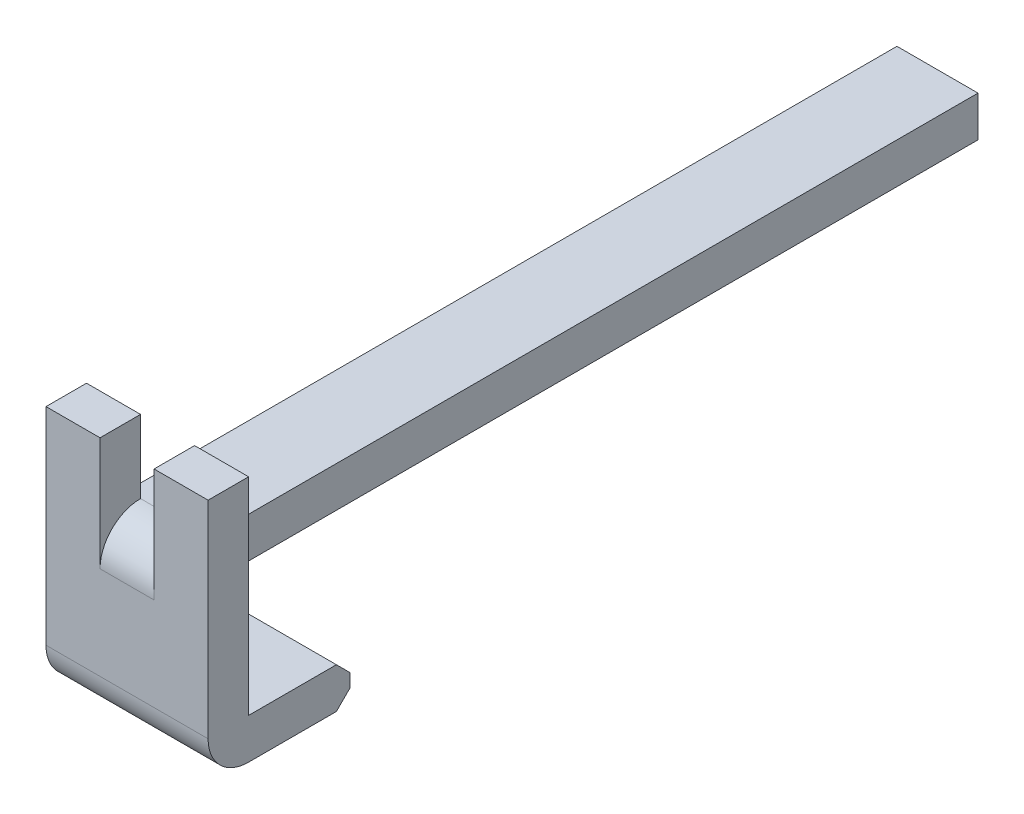
ISO-10303-21;
HEADER;
FILE_DESCRIPTION(('STEP AP214'),'2;1');
FILE_NAME('part.step','',(''),(''),'','','');
FILE_SCHEMA(('AUTOMOTIVE_DESIGN { 1 0 10303 214 1 1 1 1 }'));
ENDSEC;
DATA;
#1=APPLICATION_CONTEXT('core data for automotive mechanical design processes');
#2=APPLICATION_PROTOCOL_DEFINITION('international standard','automotive_design',2000,#1);
#3=PRODUCT_CONTEXT('',#1,'mechanical');
#4=PRODUCT('Part','Part','',(#3));
#5=PRODUCT_RELATED_PRODUCT_CATEGORY('part','',(#4));
#6=PRODUCT_DEFINITION_FORMATION('','',#4);
#7=PRODUCT_DEFINITION_CONTEXT('part definition',#1,'design');
#8=PRODUCT_DEFINITION('design','',#6,#7);
#9=PRODUCT_DEFINITION_SHAPE('','',#8);
#10=(LENGTH_UNIT() NAMED_UNIT(*) SI_UNIT(.MILLI.,.METRE.));
#11=(NAMED_UNIT(*) PLANE_ANGLE_UNIT() SI_UNIT($,.RADIAN.));
#12=(NAMED_UNIT(*) SI_UNIT($,.STERADIAN.) SOLID_ANGLE_UNIT());
#13=UNCERTAINTY_MEASURE_WITH_UNIT(LENGTH_MEASURE(1.E-05),#10,'distance_accuracy_value','');
#14=(GEOMETRIC_REPRESENTATION_CONTEXT(3) GLOBAL_UNCERTAINTY_ASSIGNED_CONTEXT((#13)) GLOBAL_UNIT_ASSIGNED_CONTEXT((#10,
#11,#12)) REPRESENTATION_CONTEXT('',''));
#15=CARTESIAN_POINT('',(0.,0.,0.));
#16=DIRECTION('',(0.,0.,1.));
#17=DIRECTION('',(1.,0.,0.));
#18=AXIS2_PLACEMENT_3D('',#15,#16,#17);
#19=CARTESIAN_POINT('',(-0.6,-1.29,-0.3));
#20=DIRECTION('',(0.,-1.,0.));
#21=DIRECTION('',(0.,0.,-1.));
#22=AXIS2_PLACEMENT_3D('',#19,#20,#21);
#23=PLANE('',#22);
#24=DIRECTION('',(0.,0.,-1.));
#25=VECTOR('',#24,1.);
#26=CARTESIAN_POINT('',(-0.6,-1.29,-0.3));
#27=LINE('',#26,#25);
#28=CARTESIAN_POINT('',(-0.6,-1.29,-0.3));
#29=VERTEX_POINT('',#28);
#30=CARTESIAN_POINT('',(-0.6,-1.29,-0.95));
#31=VERTEX_POINT('',#30);
#32=EDGE_CURVE('E261',#29,#31,#27,.T.);
#33=ORIENTED_EDGE('',*,*,#32,.T.);
#34=DIRECTION('',(1.,0.,0.));
#35=VECTOR('',#34,1.);
#36=CARTESIAN_POINT('',(-0.6,-1.29,-0.95));
#37=LINE('',#36,#35);
#38=CARTESIAN_POINT('',(0.600000000000001,-1.29,-0.95));
#39=VERTEX_POINT('',#38);
#40=EDGE_CURVE('E75',#39,#31,#37,.F.);
#41=ORIENTED_EDGE('',*,*,#40,.F.);
#42=DIRECTION('',(0.,0.,1.));
#43=VECTOR('',#42,1.);
#44=CARTESIAN_POINT('',(0.600000000000001,-1.29,-0.3));
#45=LINE('',#44,#43);
#46=CARTESIAN_POINT('',(0.6,-1.29,-0.3));
#47=VERTEX_POINT('',#46);
#48=EDGE_CURVE('E285',#39,#47,#45,.T.);
#49=ORIENTED_EDGE('',*,*,#48,.T.);
#50=DIRECTION('',(-1.,0.,0.));
#51=VECTOR('',#50,1.);
#52=CARTESIAN_POINT('',(-0.6,-1.29,-0.3));
#53=LINE('',#52,#51);
#54=EDGE_CURVE('E65',#29,#47,#53,.F.);
#55=ORIENTED_EDGE('',*,*,#54,.F.);
#56=EDGE_LOOP('',(#33,#41,#49,#55));
#57=FACE_BOUND('',#56,.T.);
#58=ADVANCED_FACE('F17',(#57),#23,.T.);
#59=CARTESIAN_POINT('',(-0.6,-1.29,-0.95));
#60=DIRECTION('',(0.,-0.707106781186548,-0.707106781186548));
#61=DIRECTION('',(0.,0.707106781186548,-0.707106781186548));
#62=AXIS2_PLACEMENT_3D('',#59,#60,#61);
#63=PLANE('',#62);
#64=DIRECTION('',(0.,0.707106781186547,-0.707106781186547));
#65=VECTOR('',#64,1.);
#66=CARTESIAN_POINT('',(-0.6,-1.29,-0.95));
#67=LINE('',#66,#65);
#68=CARTESIAN_POINT('',(-0.6,-1.19,-1.05));
#69=VERTEX_POINT('',#68);
#70=EDGE_CURVE('E263',#31,#69,#67,.T.);
#71=ORIENTED_EDGE('',*,*,#70,.T.);
#72=DIRECTION('',(1.,0.,0.));
#73=VECTOR('',#72,1.);
#74=CARTESIAN_POINT('',(-0.6,-1.19,-1.05));
#75=LINE('',#74,#73);
#76=CARTESIAN_POINT('',(0.6,-1.19,-1.05));
#77=VERTEX_POINT('',#76);
#78=EDGE_CURVE('E84',#77,#69,#75,.F.);
#79=ORIENTED_EDGE('',*,*,#78,.F.);
#80=DIRECTION('',(0.,-0.707106781186547,0.707106781186547));
#81=VECTOR('',#80,1.);
#82=CARTESIAN_POINT('',(0.600000000000001,-1.19,-1.05));
#83=LINE('',#82,#81);
#84=EDGE_CURVE('E287',#77,#39,#83,.T.);
#85=ORIENTED_EDGE('',*,*,#84,.T.);
#86=ORIENTED_EDGE('',*,*,#40,.T.);
#87=EDGE_LOOP('',(#71,#79,#85,#86));
#88=FACE_BOUND('',#87,.T.);
#89=ADVANCED_FACE('F389',(#88),#63,.T.);
#90=CARTESIAN_POINT('',(-0.6,-1.19,-1.05));
#91=DIRECTION('',(0.,0.,-1.));
#92=DIRECTION('',(0.,1.,0.));
#93=AXIS2_PLACEMENT_3D('',#90,#91,#92);
#94=PLANE('',#93);
#95=DIRECTION('',(0.,1.,0.));
#96=VECTOR('',#95,1.);
#97=CARTESIAN_POINT('',(-0.6,-0.99,-1.05));
#98=LINE('',#97,#96);
#99=CARTESIAN_POINT('',(-0.6,-1.09,-1.05));
#100=VERTEX_POINT('',#99);
#101=EDGE_CURVE('E326',#69,#100,#98,.T.);
#102=ORIENTED_EDGE('',*,*,#101,.T.);
#103=DIRECTION('',(1.,0.,0.));
#104=VECTOR('',#103,1.);
#105=CARTESIAN_POINT('',(-0.6,-1.09,-1.05));
#106=LINE('',#105,#104);
#107=CARTESIAN_POINT('',(0.600000000000001,-1.09,-1.05));
#108=VERTEX_POINT('',#107);
#109=EDGE_CURVE('E102',#108,#100,#106,.F.);
#110=ORIENTED_EDGE('',*,*,#109,.F.);
#111=DIRECTION('',(0.,-1.,0.));
#112=VECTOR('',#111,1.);
#113=CARTESIAN_POINT('',(0.6,0.54,-1.05));
#114=LINE('',#113,#112);
#115=EDGE_CURVE('E347',#108,#77,#114,.T.);
#116=ORIENTED_EDGE('',*,*,#115,.T.);
#117=ORIENTED_EDGE('',*,*,#78,.T.);
#118=EDGE_LOOP('',(#102,#110,#116,#117));
#119=FACE_BOUND('',#118,.T.);
#120=ADVANCED_FACE('F385',(#119),#94,.T.);
#121=CARTESIAN_POINT('',(-0.6,-1.09,-1.05));
#122=DIRECTION('',(0.,0.707106781186548,-0.707106781186548));
#123=DIRECTION('',(0.,0.707106781186548,0.707106781186548));
#124=AXIS2_PLACEMENT_3D('',#121,#122,#123);
#125=PLANE('',#124);
#126=DIRECTION('',(0.,0.707106781186547,0.707106781186548));
#127=VECTOR('',#126,1.);
#128=CARTESIAN_POINT('',(-0.6,-1.09,-1.05));
#129=LINE('',#128,#127);
#130=CARTESIAN_POINT('',(-0.6,-0.99,-0.95));
#131=VERTEX_POINT('',#130);
#132=EDGE_CURVE('E270',#100,#131,#129,.T.);
#133=ORIENTED_EDGE('',*,*,#132,.T.);
#134=DIRECTION('',(1.,0.,0.));
#135=VECTOR('',#134,1.);
#136=CARTESIAN_POINT('',(-0.6,-0.990000000000001,-0.95));
#137=LINE('',#136,#135);
#138=CARTESIAN_POINT('',(0.6,-0.99,-0.95));
#139=VERTEX_POINT('',#138);
#140=EDGE_CURVE('E279',#139,#131,#137,.F.);
#141=ORIENTED_EDGE('',*,*,#140,.F.);
#142=DIRECTION('',(0.,-0.707106781186546,-0.707106781186549));
#143=VECTOR('',#142,1.);
#144=CARTESIAN_POINT('',(0.6,-0.99,-0.95));
#145=LINE('',#144,#143);
#146=EDGE_CURVE('E345',#139,#108,#145,.T.);
#147=ORIENTED_EDGE('',*,*,#146,.T.);
#148=ORIENTED_EDGE('',*,*,#109,.T.);
#149=EDGE_LOOP('',(#133,#141,#147,#148));
#150=FACE_BOUND('',#149,.T.);
#151=ADVANCED_FACE('F384',(#150),#125,.T.);
#152=CARTESIAN_POINT('',(-0.6,-0.99,-0.3));
#153=DIRECTION('',(-1.,0.,0.));
#154=DIRECTION('',(0.,0.,1.));
#155=AXIS2_PLACEMENT_3D('',#152,#153,#154);
#156=CYLINDRICAL_SURFACE('',#155,0.3);
#157=CARTESIAN_POINT('',(-0.6,-0.99,-0.3));
#158=DIRECTION('',(-1.,0.,0.));
#159=DIRECTION('',(0.,0.,1.));
#160=AXIS2_PLACEMENT_3D('',#157,#158,#159);
#161=CIRCLE('',#160,0.3);
#162=CARTESIAN_POINT('',(-0.6,-0.99,0.));
#163=VERTEX_POINT('',#162);
#164=EDGE_CURVE('E264',#163,#29,#161,.F.);
#165=ORIENTED_EDGE('',*,*,#164,.T.);
#166=ORIENTED_EDGE('',*,*,#54,.T.);
#167=CARTESIAN_POINT('',(0.6,-0.99,-0.3));
#168=DIRECTION('',(-1.,0.,0.));
#169=DIRECTION('',(0.,0.,1.));
#170=AXIS2_PLACEMENT_3D('',#167,#168,#169);
#171=CIRCLE('',#170,0.3);
#172=CARTESIAN_POINT('',(0.6,-0.99,0.));
#173=VERTEX_POINT('',#172);
#174=EDGE_CURVE('E20',#47,#173,#171,.T.);
#175=ORIENTED_EDGE('',*,*,#174,.T.);
#176=DIRECTION('',(-1.,0.,0.));
#177=VECTOR('',#176,1.);
#178=CARTESIAN_POINT('',(0.3,-0.99,0.));
#179=LINE('',#178,#177);
#180=EDGE_CURVE('E313',#173,#163,#179,.T.);
#181=ORIENTED_EDGE('',*,*,#180,.T.);
#182=EDGE_LOOP('',(#165,#166,#175,#181));
#183=FACE_BOUND('',#182,.T.);
#184=ADVANCED_FACE('F359',(#183),#156,.T.);
#185=CARTESIAN_POINT('',(0.6,0.54,-0.3));
#186=DIRECTION('',(-1.,0.,0.));
#187=DIRECTION('',(0.,-1.,0.));
#188=AXIS2_PLACEMENT_3D('',#185,#186,#187);
#189=PLANE('',#188);
#190=ORIENTED_EDGE('',*,*,#174,.F.);
#191=ORIENTED_EDGE('',*,*,#48,.F.);
#192=ORIENTED_EDGE('',*,*,#84,.F.);
#193=ORIENTED_EDGE('',*,*,#115,.F.);
#194=ORIENTED_EDGE('',*,*,#146,.F.);
#195=DIRECTION('',(0.,0.,1.));
#196=VECTOR('',#195,1.);
#197=CARTESIAN_POINT('',(0.6,-0.99,0.));
#198=LINE('',#197,#196);
#199=CARTESIAN_POINT('',(0.6,-0.99,-0.3));
#200=VERTEX_POINT('',#199);
#201=EDGE_CURVE('E276',#200,#139,#198,.F.);
#202=ORIENTED_EDGE('',*,*,#201,.F.);
#203=DIRECTION('',(0.,1.,0.));
#204=VECTOR('',#203,1.);
#205=CARTESIAN_POINT('',(0.6,0.,-0.3));
#206=LINE('',#205,#204);
#207=CARTESIAN_POINT('',(0.6,0.54,-0.3));
#208=VERTEX_POINT('',#207);
#209=EDGE_CURVE('E249',#208,#200,#206,.F.);
#210=ORIENTED_EDGE('',*,*,#209,.F.);
#211=DIRECTION('',(0.,0.,1.));
#212=VECTOR('',#211,1.);
#213=CARTESIAN_POINT('',(0.6,0.54,-0.3));
#214=LINE('',#213,#212);
#215=CARTESIAN_POINT('',(0.6,0.54,0.));
#216=VERTEX_POINT('',#215);
#217=EDGE_CURVE('E254',#208,#216,#214,.T.);
#218=ORIENTED_EDGE('',*,*,#217,.T.);
#219=DIRECTION('',(0.,1.,0.));
#220=VECTOR('',#219,1.);
#221=CARTESIAN_POINT('',(0.6,-0.3,0.));
#222=LINE('',#221,#220);
#223=EDGE_CURVE('E235',#216,#173,#222,.F.);
#224=ORIENTED_EDGE('',*,*,#223,.T.);
#225=EDGE_LOOP('',(#190,#191,#192,#193,#194,#202,#210,#218,#224));
#226=FACE_BOUND('',#225,.T.);
#227=ADVANCED_FACE('F388',(#226),#189,.F.);
#228=CARTESIAN_POINT('',(-0.6,-0.99,0.));
#229=DIRECTION('',(0.,1.,0.));
#230=DIRECTION('',(0.,0.,1.));
#231=AXIS2_PLACEMENT_3D('',#228,#229,#230);
#232=PLANE('',#231);
#233=ORIENTED_EDGE('',*,*,#140,.T.);
#234=DIRECTION('',(0.,0.,-1.));
#235=VECTOR('',#234,1.);
#236=CARTESIAN_POINT('',(-0.6,-0.99,-0.3));
#237=LINE('',#236,#235);
#238=CARTESIAN_POINT('',(-0.6,-0.99,-0.3));
#239=VERTEX_POINT('',#238);
#240=EDGE_CURVE('E267',#131,#239,#237,.F.);
#241=ORIENTED_EDGE('',*,*,#240,.T.);
#242=DIRECTION('',(-1.,0.,0.));
#243=VECTOR('',#242,1.);
#244=CARTESIAN_POINT('',(0.,-0.99,-0.3));
#245=LINE('',#244,#243);
#246=EDGE_CURVE('E258',#200,#239,#245,.T.);
#247=ORIENTED_EDGE('',*,*,#246,.F.);
#248=ORIENTED_EDGE('',*,*,#201,.T.);
#249=EDGE_LOOP('',(#233,#241,#247,#248));
#250=FACE_BOUND('',#249,.T.);
#251=ADVANCED_FACE('F382',(#250),#232,.T.);
#252=CARTESIAN_POINT('',(-0.6,-0.99,-0.3));
#253=DIRECTION('',(1.,0.,0.));
#254=DIRECTION('',(0.,0.,-1.));
#255=AXIS2_PLACEMENT_3D('',#252,#253,#254);
#256=PLANE('',#255);
#257=DIRECTION('',(0.,0.,-1.));
#258=VECTOR('',#257,1.);
#259=CARTESIAN_POINT('',(-0.6,0.54,-0.3));
#260=LINE('',#259,#258);
#261=CARTESIAN_POINT('',(-0.6,0.54,0.));
#262=VERTEX_POINT('',#261);
#263=CARTESIAN_POINT('',(-0.6,0.54,-0.3));
#264=VERTEX_POINT('',#263);
#265=EDGE_CURVE('E236',#262,#264,#260,.T.);
#266=ORIENTED_EDGE('',*,*,#265,.T.);
#267=DIRECTION('',(0.,1.,0.));
#268=VECTOR('',#267,1.);
#269=CARTESIAN_POINT('',(-0.6,0.,-0.3));
#270=LINE('',#269,#268);
#271=EDGE_CURVE('E229',#239,#264,#270,.T.);
#272=ORIENTED_EDGE('',*,*,#271,.F.);
#273=ORIENTED_EDGE('',*,*,#240,.F.);
#274=ORIENTED_EDGE('',*,*,#132,.F.);
#275=ORIENTED_EDGE('',*,*,#101,.F.);
#276=ORIENTED_EDGE('',*,*,#70,.F.);
#277=ORIENTED_EDGE('',*,*,#32,.F.);
#278=ORIENTED_EDGE('',*,*,#164,.F.);
#279=DIRECTION('',(0.,1.,0.));
#280=VECTOR('',#279,1.);
#281=CARTESIAN_POINT('',(-0.6,-0.3,0.));
#282=LINE('',#281,#280);
#283=EDGE_CURVE('E216',#163,#262,#282,.T.);
#284=ORIENTED_EDGE('',*,*,#283,.T.);
#285=EDGE_LOOP('',(#266,#272,#273,#274,#275,#276,#277,#278,#284));
#286=FACE_BOUND('',#285,.T.);
#287=ADVANCED_FACE('F364',(#286),#256,.F.);
#288=CARTESIAN_POINT('',(0.2,0.54,-0.3));
#289=DIRECTION('',(0.,-1.,0.));
#290=DIRECTION('',(1.,0.,0.));
#291=AXIS2_PLACEMENT_3D('',#288,#289,#290);
#292=PLANE('',#291);
#293=ORIENTED_EDGE('',*,*,#217,.F.);
#294=DIRECTION('',(-1.,0.,0.));
#295=VECTOR('',#294,1.);
#296=CARTESIAN_POINT('',(0.,0.54,-0.3));
#297=LINE('',#296,#295);
#298=CARTESIAN_POINT('',(0.2,0.54,-0.3));
#299=VERTEX_POINT('',#298);
#300=EDGE_CURVE('E244',#299,#208,#297,.F.);
#301=ORIENTED_EDGE('',*,*,#300,.F.);
#302=DIRECTION('',(0.,0.,1.));
#303=VECTOR('',#302,1.);
#304=CARTESIAN_POINT('',(0.2,0.54,-0.3));
#305=LINE('',#304,#303);
#306=CARTESIAN_POINT('',(0.2,0.54,0.));
#307=VERTEX_POINT('',#306);
#308=EDGE_CURVE('E202',#299,#307,#305,.T.);
#309=ORIENTED_EDGE('',*,*,#308,.T.);
#310=DIRECTION('',(-1.,0.,0.));
#311=VECTOR('',#310,1.);
#312=CARTESIAN_POINT('',(0.3,0.54,0.));
#313=LINE('',#312,#311);
#314=EDGE_CURVE('E232',#307,#216,#313,.F.);
#315=ORIENTED_EDGE('',*,*,#314,.T.);
#316=EDGE_LOOP('',(#293,#301,#309,#315));
#317=FACE_BOUND('',#316,.T.);
#318=ADVANCED_FACE('F432',(#317),#292,.F.);
#319=CARTESIAN_POINT('',(-0.6,0.54,-0.3));
#320=DIRECTION('',(0.,-1.,0.));
#321=DIRECTION('',(0.,0.,-1.));
#322=AXIS2_PLACEMENT_3D('',#319,#320,#321);
#323=PLANE('',#322);
#324=DIRECTION('',(0.,0.,1.));
#325=VECTOR('',#324,1.);
#326=CARTESIAN_POINT('',(-0.2,0.54,-0.3));
#327=LINE('',#326,#325);
#328=CARTESIAN_POINT('',(-0.2,0.54,0.));
#329=VERTEX_POINT('',#328);
#330=CARTESIAN_POINT('',(-0.2,0.54,-0.3));
#331=VERTEX_POINT('',#330);
#332=EDGE_CURVE('E196',#329,#331,#327,.F.);
#333=ORIENTED_EDGE('',*,*,#332,.T.);
#334=DIRECTION('',(-1.,0.,0.));
#335=VECTOR('',#334,1.);
#336=CARTESIAN_POINT('',(0.,0.54,-0.3));
#337=LINE('',#336,#335);
#338=EDGE_CURVE('E227',#264,#331,#337,.F.);
#339=ORIENTED_EDGE('',*,*,#338,.F.);
#340=ORIENTED_EDGE('',*,*,#265,.F.);
#341=DIRECTION('',(-1.,0.,0.));
#342=VECTOR('',#341,1.);
#343=CARTESIAN_POINT('',(0.3,0.54,0.));
#344=LINE('',#343,#342);
#345=EDGE_CURVE('E213',#262,#329,#344,.F.);
#346=ORIENTED_EDGE('',*,*,#345,.T.);
#347=EDGE_LOOP('',(#333,#339,#340,#346));
#348=FACE_BOUND('',#347,.T.);
#349=ADVANCED_FACE('F371',(#348),#323,.F.);
#350=CARTESIAN_POINT('',(0.3,-0.3,0.));
#351=DIRECTION('',(0.,0.,-1.));
#352=DIRECTION('',(-1.,0.,0.));
#353=AXIS2_PLACEMENT_3D('',#350,#351,#352);
#354=PLANE('',#353);
#355=DIRECTION('',(0.,-1.,0.));
#356=VECTOR('',#355,1.);
#357=CARTESIAN_POINT('',(-0.2,0.54,0.));
#358=LINE('',#357,#356);
#359=CARTESIAN_POINT('',(-0.2,-0.3,0.));
#360=VERTEX_POINT('',#359);
#361=EDGE_CURVE('E189',#360,#329,#358,.F.);
#362=ORIENTED_EDGE('',*,*,#361,.T.);
#363=ORIENTED_EDGE('',*,*,#345,.F.);
#364=ORIENTED_EDGE('',*,*,#283,.F.);
#365=ORIENTED_EDGE('',*,*,#180,.F.);
#366=ORIENTED_EDGE('',*,*,#223,.F.);
#367=ORIENTED_EDGE('',*,*,#314,.F.);
#368=DIRECTION('',(0.,1.,0.));
#369=VECTOR('',#368,1.);
#370=CARTESIAN_POINT('',(0.2,0.,0.));
#371=LINE('',#370,#369);
#372=CARTESIAN_POINT('',(0.2,-0.3,0.));
#373=VERTEX_POINT('',#372);
#374=EDGE_CURVE('E199',#307,#373,#371,.F.);
#375=ORIENTED_EDGE('',*,*,#374,.T.);
#376=DIRECTION('',(-1.,0.,0.));
#377=VECTOR('',#376,1.);
#378=CARTESIAN_POINT('',(0.3,-0.3,0.));
#379=LINE('',#378,#377);
#380=EDGE_CURVE('E211',#360,#373,#379,.F.);
#381=ORIENTED_EDGE('',*,*,#380,.F.);
#382=EDGE_LOOP('',(#362,#363,#364,#365,#366,#367,#375,#381));
#383=FACE_BOUND('',#382,.T.);
#384=ADVANCED_FACE('F367',(#383),#354,.F.);
#385=CARTESIAN_POINT('',(0.,0.,-0.3));
#386=DIRECTION('',(0.,0.,-1.));
#387=DIRECTION('',(-1.,0.,0.));
#388=AXIS2_PLACEMENT_3D('',#385,#386,#387);
#389=PLANE('',#388);
#390=ORIENTED_EDGE('',*,*,#338,.T.);
#391=DIRECTION('',(0.,-1.,0.));
#392=VECTOR('',#391,1.);
#393=CARTESIAN_POINT('',(-0.2,0.54,-0.3));
#394=LINE('',#393,#392);
#395=CARTESIAN_POINT('',(-0.2,0.,-0.3));
#396=VERTEX_POINT('',#395);
#397=EDGE_CURVE('E192',#331,#396,#394,.T.);
#398=ORIENTED_EDGE('',*,*,#397,.T.);
#399=DIRECTION('',(-1.,0.,0.));
#400=VECTOR('',#399,1.);
#401=CARTESIAN_POINT('',(0.,0.,-0.3));
#402=LINE('',#401,#400);
#403=CARTESIAN_POINT('',(-0.3,0.,-0.3));
#404=VERTEX_POINT('',#403);
#405=EDGE_CURVE('E35',#396,#404,#402,.T.);
#406=ORIENTED_EDGE('',*,*,#405,.T.);
#407=DIRECTION('',(0.,1.,0.));
#408=VECTOR('',#407,1.);
#409=CARTESIAN_POINT('',(-0.3,-0.3,-0.3));
#410=LINE('',#409,#408);
#411=CARTESIAN_POINT('',(-0.3,-0.3,-0.3));
#412=VERTEX_POINT('',#411);
#413=EDGE_CURVE('E188',#404,#412,#410,.F.);
#414=ORIENTED_EDGE('',*,*,#413,.T.);
#415=DIRECTION('',(1.,0.,0.));
#416=VECTOR('',#415,1.);
#417=CARTESIAN_POINT('',(0.,-0.3,-0.3));
#418=LINE('',#417,#416);
#419=CARTESIAN_POINT('',(0.3,-0.3,-0.3));
#420=VERTEX_POINT('',#419);
#421=EDGE_CURVE('E208',#420,#412,#418,.F.);
#422=ORIENTED_EDGE('',*,*,#421,.F.);
#423=DIRECTION('',(0.,1.,0.));
#424=VECTOR('',#423,1.);
#425=CARTESIAN_POINT('',(0.3,0.,-0.3));
#426=LINE('',#425,#424);
#427=CARTESIAN_POINT('',(0.3,0.,-0.3));
#428=VERTEX_POINT('',#427);
#429=EDGE_CURVE('E224',#420,#428,#426,.T.);
#430=ORIENTED_EDGE('',*,*,#429,.T.);
#431=DIRECTION('',(-1.,0.,0.));
#432=VECTOR('',#431,1.);
#433=CARTESIAN_POINT('',(0.,0.,-0.3));
#434=LINE('',#433,#432);
#435=CARTESIAN_POINT('',(0.2,0.,-0.3));
#436=VERTEX_POINT('',#435);
#437=EDGE_CURVE('E174',#428,#436,#434,.T.);
#438=ORIENTED_EDGE('',*,*,#437,.T.);
#439=DIRECTION('',(0.,1.,0.));
#440=VECTOR('',#439,1.);
#441=CARTESIAN_POINT('',(0.2,0.,-0.3));
#442=LINE('',#441,#440);
#443=EDGE_CURVE('E205',#436,#299,#442,.T.);
#444=ORIENTED_EDGE('',*,*,#443,.T.);
#445=ORIENTED_EDGE('',*,*,#300,.T.);
#446=ORIENTED_EDGE('',*,*,#209,.T.);
#447=ORIENTED_EDGE('',*,*,#246,.T.);
#448=ORIENTED_EDGE('',*,*,#271,.T.);
#449=EDGE_LOOP('',(#390,#398,#406,#414,#422,#430,#438,#444,#445,#446,#447,#448));
#450=FACE_BOUND('',#449,.T.);
#451=ADVANCED_FACE('F376',(#450),#389,.T.);
#452=CARTESIAN_POINT('',(0.,-0.3,0.));
#453=DIRECTION('',(0.,-1.,0.));
#454=DIRECTION('',(0.,0.,-1.));
#455=AXIS2_PLACEMENT_3D('',#452,#453,#454);
#456=PLANE('',#455);
#457=DIRECTION('',(1.,0.,0.));
#458=VECTOR('',#457,1.);
#459=CARTESIAN_POINT('',(-0.3,-0.3,-6.));
#460=LINE('',#459,#458);
#461=CARTESIAN_POINT('',(-0.3,-0.3,-6.));
#462=VERTEX_POINT('',#461);
#463=CARTESIAN_POINT('',(0.3,-0.3,-6.));
#464=VERTEX_POINT('',#463);
#465=EDGE_CURVE('E168',#462,#464,#460,.T.);
#466=ORIENTED_EDGE('',*,*,#465,.T.);
#467=DIRECTION('',(0.,0.,1.));
#468=VECTOR('',#467,1.);
#469=CARTESIAN_POINT('',(0.3,-0.3,-6.));
#470=LINE('',#469,#468);
#471=EDGE_CURVE('E164',#464,#420,#470,.T.);
#472=ORIENTED_EDGE('',*,*,#471,.T.);
#473=ORIENTED_EDGE('',*,*,#421,.T.);
#474=DIRECTION('',(0.,0.,-1.));
#475=VECTOR('',#474,1.);
#476=CARTESIAN_POINT('',(-0.3,-0.3,0.));
#477=LINE('',#476,#475);
#478=EDGE_CURVE('E186',#412,#462,#477,.T.);
#479=ORIENTED_EDGE('',*,*,#478,.T.);
#480=EDGE_LOOP('',(#466,#472,#473,#479));
#481=FACE_BOUND('',#480,.T.);
#482=ADVANCED_FACE('F421',(#481),#456,.T.);
#483=CARTESIAN_POINT('',(0.2,0.,-0.3));
#484=DIRECTION('',(1.,0.,0.));
#485=DIRECTION('',(0.,1.,0.));
#486=AXIS2_PLACEMENT_3D('',#483,#484,#485);
#487=PLANE('',#486);
#488=ORIENTED_EDGE('',*,*,#308,.F.);
#489=ORIENTED_EDGE('',*,*,#443,.F.);
#490=CARTESIAN_POINT('',(0.2,-0.3,-0.3));
#491=DIRECTION('',(1.,0.,0.));
#492=DIRECTION('',(0.,0.,-1.));
#493=AXIS2_PLACEMENT_3D('',#490,#491,#492);
#494=CIRCLE('',#493,0.3);
#495=EDGE_CURVE('E302',#373,#436,#494,.F.);
#496=ORIENTED_EDGE('',*,*,#495,.F.);
#497=ORIENTED_EDGE('',*,*,#374,.F.);
#498=EDGE_LOOP('',(#488,#489,#496,#497));
#499=FACE_BOUND('',#498,.T.);
#500=ADVANCED_FACE('F417',(#499),#487,.F.);
#501=CARTESIAN_POINT('',(-0.2,0.54,-0.3));
#502=DIRECTION('',(-1.,0.,0.));
#503=DIRECTION('',(0.,-1.,0.));
#504=AXIS2_PLACEMENT_3D('',#501,#502,#503);
#505=PLANE('',#504);
#506=CARTESIAN_POINT('',(-0.2,-0.3,-0.3));
#507=DIRECTION('',(1.,0.,0.));
#508=DIRECTION('',(0.,0.,-1.));
#509=AXIS2_PLACEMENT_3D('',#506,#507,#508);
#510=CIRCLE('',#509,0.3);
#511=EDGE_CURVE('E181',#396,#360,#510,.T.);
#512=ORIENTED_EDGE('',*,*,#511,.F.);
#513=ORIENTED_EDGE('',*,*,#397,.F.);
#514=ORIENTED_EDGE('',*,*,#332,.F.);
#515=ORIENTED_EDGE('',*,*,#361,.F.);
#516=EDGE_LOOP('',(#512,#513,#514,#515));
#517=FACE_BOUND('',#516,.T.);
#518=ADVANCED_FACE('F413',(#517),#505,.F.);
#519=CARTESIAN_POINT('',(-0.3,-0.3,0.));
#520=DIRECTION('',(1.,0.,0.));
#521=DIRECTION('',(0.,0.,-1.));
#522=AXIS2_PLACEMENT_3D('',#519,#520,#521);
#523=PLANE('',#522);
#524=ORIENTED_EDGE('',*,*,#413,.F.);
#525=DIRECTION('',(0.,0.,-1.));
#526=VECTOR('',#525,1.);
#527=CARTESIAN_POINT('',(-0.3,0.,0.));
#528=LINE('',#527,#526);
#529=CARTESIAN_POINT('',(-0.3,0.,-6.));
#530=VERTEX_POINT('',#529);
#531=EDGE_CURVE('E179',#404,#530,#528,.T.);
#532=ORIENTED_EDGE('',*,*,#531,.T.);
#533=DIRECTION('',(0.,1.,0.));
#534=VECTOR('',#533,1.);
#535=CARTESIAN_POINT('',(-0.3,-0.3,-6.));
#536=LINE('',#535,#534);
#537=EDGE_CURVE('E178',#530,#462,#536,.F.);
#538=ORIENTED_EDGE('',*,*,#537,.T.);
#539=ORIENTED_EDGE('',*,*,#478,.F.);
#540=EDGE_LOOP('',(#524,#532,#538,#539));
#541=FACE_BOUND('',#540,.T.);
#542=ADVANCED_FACE('F410',(#541),#523,.F.);
#543=CARTESIAN_POINT('',(-0.3,-0.3,-6.));
#544=DIRECTION('',(0.,0.,1.));
#545=DIRECTION('',(1.,0.,0.));
#546=AXIS2_PLACEMENT_3D('',#543,#544,#545);
#547=PLANE('',#546);
#548=DIRECTION('',(0.,1.,0.));
#549=VECTOR('',#548,1.);
#550=CARTESIAN_POINT('',(0.3,-0.3,-6.));
#551=LINE('',#550,#549);
#552=CARTESIAN_POINT('',(0.3,0.,-6.));
#553=VERTEX_POINT('',#552);
#554=EDGE_CURVE('E159',#553,#464,#551,.F.);
#555=ORIENTED_EDGE('',*,*,#554,.T.);
#556=ORIENTED_EDGE('',*,*,#465,.F.);
#557=ORIENTED_EDGE('',*,*,#537,.F.);
#558=DIRECTION('',(1.,0.,0.));
#559=VECTOR('',#558,1.);
#560=CARTESIAN_POINT('',(0.,0.,-6.));
#561=LINE('',#560,#559);
#562=EDGE_CURVE('E172',#530,#553,#561,.T.);
#563=ORIENTED_EDGE('',*,*,#562,.T.);
#564=EDGE_LOOP('',(#555,#556,#557,#563));
#565=FACE_BOUND('',#564,.T.);
#566=ADVANCED_FACE('F176',(#565),#547,.F.);
#567=CARTESIAN_POINT('',(0.3,-0.3,-6.));
#568=DIRECTION('',(-1.,0.,0.));
#569=DIRECTION('',(0.,0.,1.));
#570=AXIS2_PLACEMENT_3D('',#567,#568,#569);
#571=PLANE('',#570);
#572=ORIENTED_EDGE('',*,*,#429,.F.);
#573=ORIENTED_EDGE('',*,*,#471,.F.);
#574=ORIENTED_EDGE('',*,*,#554,.F.);
#575=DIRECTION('',(0.,0.,-1.));
#576=VECTOR('',#575,1.);
#577=CARTESIAN_POINT('',(0.3,0.,0.));
#578=LINE('',#577,#576);
#579=EDGE_CURVE('E26',#553,#428,#578,.F.);
#580=ORIENTED_EDGE('',*,*,#579,.T.);
#581=EDGE_LOOP('',(#572,#573,#574,#580));
#582=FACE_BOUND('',#581,.T.);
#583=ADVANCED_FACE('F161',(#582),#571,.F.);
#584=CARTESIAN_POINT('',(0.3,-0.3,-0.3));
#585=DIRECTION('',(1.,0.,0.));
#586=DIRECTION('',(0.,0.,-1.));
#587=AXIS2_PLACEMENT_3D('',#584,#585,#586);
#588=CYLINDRICAL_SURFACE('',#587,0.3);
#589=ORIENTED_EDGE('',*,*,#511,.T.);
#590=ORIENTED_EDGE('',*,*,#380,.T.);
#591=ORIENTED_EDGE('',*,*,#495,.T.);
#592=DIRECTION('',(1.,0.,0.));
#593=VECTOR('',#592,1.);
#594=CARTESIAN_POINT('',(0.,0.,-0.3));
#595=LINE('',#594,#593);
#596=EDGE_CURVE('E11',#436,#396,#595,.F.);
#597=ORIENTED_EDGE('',*,*,#596,.T.);
#598=EDGE_LOOP('',(#589,#590,#591,#597));
#599=FACE_BOUND('',#598,.T.);
#600=ADVANCED_FACE('F398',(#599),#588,.T.);
#601=CARTESIAN_POINT('',(0.,0.,0.));
#602=DIRECTION('',(0.,-1.,0.));
#603=DIRECTION('',(0.,0.,-1.));
#604=AXIS2_PLACEMENT_3D('',#601,#602,#603);
#605=PLANE('',#604);
#606=ORIENTED_EDGE('',*,*,#596,.F.);
#607=ORIENTED_EDGE('',*,*,#437,.F.);
#608=ORIENTED_EDGE('',*,*,#579,.F.);
#609=ORIENTED_EDGE('',*,*,#562,.F.);
#610=ORIENTED_EDGE('',*,*,#531,.F.);
#611=ORIENTED_EDGE('',*,*,#405,.F.);
#612=EDGE_LOOP('',(#606,#607,#608,#609,#610,#611));
#613=FACE_BOUND('',#612,.T.);
#614=ADVANCED_FACE('F171',(#613),#605,.F.);
#615=CLOSED_SHELL('',(#58,#89,#120,#151,#184,#227,#251,#287,#318,#349,#384,#451,#482,#500,#518,
#542,#566,#583,#600,#614));
#616=MANIFOLD_SOLID_BREP('B1',#615);
#617=ADVANCED_BREP_SHAPE_REPRESENTATION('',(#18,#616),#14);
#618=SHAPE_DEFINITION_REPRESENTATION(#9,#617);
ENDSEC;
END-ISO-10303-21;
